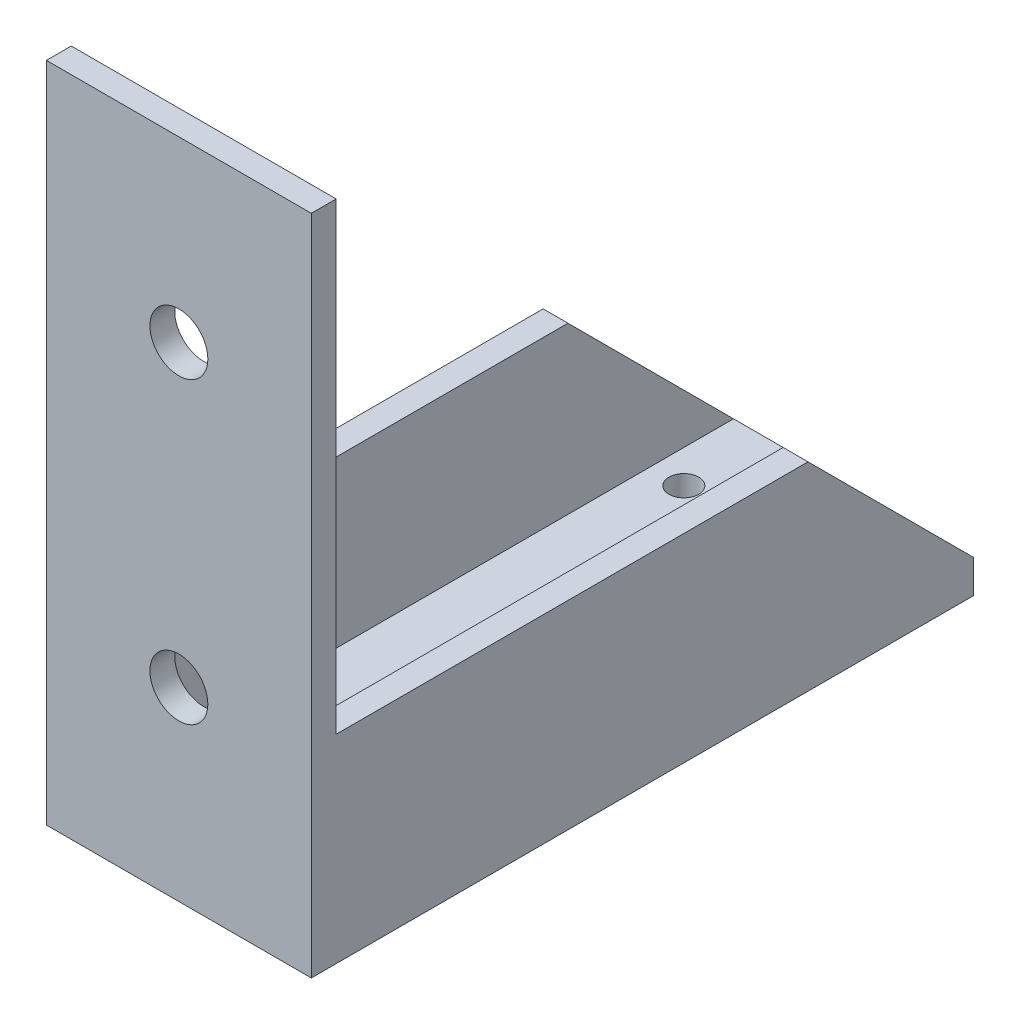
ISO-10303-21;
HEADER;
FILE_DESCRIPTION(('STEP AP214'),'2;1');
FILE_NAME('part.step','',(''),(''),'','','');
FILE_SCHEMA(('AUTOMOTIVE_DESIGN { 1 0 10303 214 1 1 1 1 }'));
ENDSEC;
DATA;
#1=APPLICATION_CONTEXT('core data for automotive mechanical design processes');
#2=APPLICATION_PROTOCOL_DEFINITION('international standard','automotive_design',2000,#1);
#3=PRODUCT_CONTEXT('',#1,'mechanical');
#4=PRODUCT('Part','Part','',(#3));
#5=PRODUCT_RELATED_PRODUCT_CATEGORY('part','',(#4));
#6=PRODUCT_DEFINITION_FORMATION('','',#4);
#7=PRODUCT_DEFINITION_CONTEXT('part definition',#1,'design');
#8=PRODUCT_DEFINITION('design','',#6,#7);
#9=PRODUCT_DEFINITION_SHAPE('','',#8);
#10=(LENGTH_UNIT() NAMED_UNIT(*) SI_UNIT(.MILLI.,.METRE.));
#11=(NAMED_UNIT(*) PLANE_ANGLE_UNIT() SI_UNIT($,.RADIAN.));
#12=(NAMED_UNIT(*) SI_UNIT($,.STERADIAN.) SOLID_ANGLE_UNIT());
#13=UNCERTAINTY_MEASURE_WITH_UNIT(LENGTH_MEASURE(1.E-05),#10,'distance_accuracy_value','');
#14=(GEOMETRIC_REPRESENTATION_CONTEXT(3) GLOBAL_UNCERTAINTY_ASSIGNED_CONTEXT((#13)) GLOBAL_UNIT_ASSIGNED_CONTEXT((#10,
#11,#12)) REPRESENTATION_CONTEXT('',''));
#15=CARTESIAN_POINT('',(0.,0.,0.));
#16=DIRECTION('',(0.,0.,1.));
#17=DIRECTION('',(1.,0.,0.));
#18=AXIS2_PLACEMENT_3D('',#15,#16,#17);
#19=CARTESIAN_POINT('',(0.,2.,0.));
#20=DIRECTION('',(0.,-1.,0.));
#21=DIRECTION('',(0.,0.,-1.));
#22=AXIS2_PLACEMENT_3D('',#19,#20,#21);
#23=PLANE('',#22);
#24=CARTESIAN_POINT('',(8.,2.,-35.));
#25=DIRECTION('',(0.,1.,0.));
#26=DIRECTION('',(0.,0.,1.));
#27=AXIS2_PLACEMENT_3D('',#24,#25,#26);
#28=CIRCLE('',#27,2.3);
#29=CARTESIAN_POINT('',(8.,2.,-32.7));
#30=VERTEX_POINT('',#29);
#31=EDGE_CURVE('E92',#30,#30,#28,.T.);
#32=ORIENTED_EDGE('',*,*,#31,.F.);
#33=EDGE_LOOP('',(#32));
#34=FACE_BOUND('',#33,.T.);
#35=CARTESIAN_POINT('',(3.5,2.,-35.));
#36=DIRECTION('',(0.,1.,0.));
#37=DIRECTION('',(0.,0.,1.));
#38=AXIS2_PLACEMENT_3D('',#35,#36,#37);
#39=CIRCLE('',#38,0.899999999999999);
#40=CARTESIAN_POINT('',(3.5,2.,-34.1));
#41=VERTEX_POINT('',#40);
#42=EDGE_CURVE('E189',#41,#41,#39,.T.);
#43=ORIENTED_EDGE('',*,*,#42,.F.);
#44=EDGE_LOOP('',(#43));
#45=FACE_BOUND('',#44,.T.);
#46=CARTESIAN_POINT('',(12.5,2.,-35.));
#47=DIRECTION('',(0.,1.,0.));
#48=DIRECTION('',(0.,0.,1.));
#49=AXIS2_PLACEMENT_3D('',#46,#47,#48);
#50=CIRCLE('',#49,0.9);
#51=CARTESIAN_POINT('',(12.5,2.,-34.1));
#52=VERTEX_POINT('',#51);
#53=EDGE_CURVE('E183',#52,#52,#50,.T.);
#54=ORIENTED_EDGE('',*,*,#53,.F.);
#55=EDGE_LOOP('',(#54));
#56=FACE_BOUND('',#55,.T.);
#57=DIRECTION('',(0.,0.,-1.));
#58=VECTOR('',#57,1.);
#59=CARTESIAN_POINT('',(1.5,2.,0.));
#60=LINE('',#59,#58);
#61=CARTESIAN_POINT('',(1.5,2.,-1.5));
#62=VERTEX_POINT('',#61);
#63=CARTESIAN_POINT('',(1.5,2.,-40.));
#64=VERTEX_POINT('',#63);
#65=EDGE_CURVE('E171',#62,#64,#60,.T.);
#66=ORIENTED_EDGE('',*,*,#65,.F.);
#67=DIRECTION('',(1.,0.,0.));
#68=VECTOR('',#67,1.);
#69=CARTESIAN_POINT('',(0.,2.,-1.5));
#70=LINE('',#69,#68);
#71=CARTESIAN_POINT('',(14.5,2.,-1.5));
#72=VERTEX_POINT('',#71);
#73=EDGE_CURVE('E131',#62,#72,#70,.T.);
#74=ORIENTED_EDGE('',*,*,#73,.T.);
#75=DIRECTION('',(0.,0.,-1.));
#76=VECTOR('',#75,1.);
#77=CARTESIAN_POINT('',(14.5,2.,0.));
#78=LINE('',#77,#76);
#79=CARTESIAN_POINT('',(14.5,2.,-40.));
#80=VERTEX_POINT('',#79);
#81=EDGE_CURVE('E154',#72,#80,#78,.T.);
#82=ORIENTED_EDGE('',*,*,#81,.T.);
#83=DIRECTION('',(-1.,0.,0.));
#84=VECTOR('',#83,1.);
#85=CARTESIAN_POINT('',(0.,2.,-40.));
#86=LINE('',#85,#84);
#87=EDGE_CURVE('E76',#80,#64,#86,.T.);
#88=ORIENTED_EDGE('',*,*,#87,.T.);
#89=EDGE_LOOP('',(#66,#74,#82,#88));
#90=FACE_BOUND('',#89,.T.);
#91=ADVANCED_FACE('F33',(#34,#45,#56,#90),#23,.F.);
#92=CARTESIAN_POINT('',(0.,0.,0.));
#93=DIRECTION('',(0.,-1.,0.));
#94=DIRECTION('',(0.,0.,-1.));
#95=AXIS2_PLACEMENT_3D('',#92,#93,#94);
#96=PLANE('',#95);
#97=DIRECTION('',(-1.,0.,0.));
#98=VECTOR('',#97,1.);
#99=CARTESIAN_POINT('',(0.,0.,-40.));
#100=LINE('',#99,#98);
#101=CARTESIAN_POINT('',(16.,0.,-40.));
#102=VERTEX_POINT('',#101);
#103=CARTESIAN_POINT('',(0.,0.,-40.));
#104=VERTEX_POINT('',#103);
#105=EDGE_CURVE('E70',#102,#104,#100,.T.);
#106=ORIENTED_EDGE('',*,*,#105,.F.);
#107=DIRECTION('',(0.,0.,-1.));
#108=VECTOR('',#107,1.);
#109=CARTESIAN_POINT('',(16.,0.,0.));
#110=LINE('',#109,#108);
#111=CARTESIAN_POINT('',(16.,0.,0.));
#112=VERTEX_POINT('',#111);
#113=EDGE_CURVE('E67',#112,#102,#110,.T.);
#114=ORIENTED_EDGE('',*,*,#113,.F.);
#115=DIRECTION('',(1.,0.,0.));
#116=VECTOR('',#115,1.);
#117=CARTESIAN_POINT('',(0.,0.,0.));
#118=LINE('',#117,#116);
#119=CARTESIAN_POINT('',(0.,0.,0.));
#120=VERTEX_POINT('',#119);
#121=EDGE_CURVE('E90',#120,#112,#118,.T.);
#122=ORIENTED_EDGE('',*,*,#121,.F.);
#123=DIRECTION('',(0.,0.,1.));
#124=VECTOR('',#123,1.);
#125=CARTESIAN_POINT('',(0.,0.,0.));
#126=LINE('',#125,#124);
#127=EDGE_CURVE('E81',#104,#120,#126,.T.);
#128=ORIENTED_EDGE('',*,*,#127,.F.);
#129=EDGE_LOOP('',(#106,#114,#122,#128));
#130=FACE_BOUND('',#129,.T.);
#131=CARTESIAN_POINT('',(3.5,0.,-35.));
#132=DIRECTION('',(0.,1.,0.));
#133=DIRECTION('',(0.,0.,1.));
#134=AXIS2_PLACEMENT_3D('',#131,#132,#133);
#135=CIRCLE('',#134,0.899999999999999);
#136=CARTESIAN_POINT('',(3.5,0.,-34.1));
#137=VERTEX_POINT('',#136);
#138=EDGE_CURVE('E186',#137,#137,#135,.T.);
#139=ORIENTED_EDGE('',*,*,#138,.T.);
#140=EDGE_LOOP('',(#139));
#141=FACE_BOUND('',#140,.T.);
#142=CARTESIAN_POINT('',(8.,0.,-35.));
#143=DIRECTION('',(0.,1.,0.));
#144=DIRECTION('',(0.,0.,1.));
#145=AXIS2_PLACEMENT_3D('',#142,#143,#144);
#146=CIRCLE('',#145,2.3);
#147=CARTESIAN_POINT('',(8.,0.,-32.7));
#148=VERTEX_POINT('',#147);
#149=EDGE_CURVE('E96',#148,#148,#146,.T.);
#150=ORIENTED_EDGE('',*,*,#149,.T.);
#151=EDGE_LOOP('',(#150));
#152=FACE_BOUND('',#151,.T.);
#153=CARTESIAN_POINT('',(12.5,0.,-35.));
#154=DIRECTION('',(0.,1.,0.));
#155=DIRECTION('',(0.,0.,1.));
#156=AXIS2_PLACEMENT_3D('',#153,#154,#155);
#157=CIRCLE('',#156,0.9);
#158=CARTESIAN_POINT('',(12.5,0.,-34.1));
#159=VERTEX_POINT('',#158);
#160=EDGE_CURVE('E182',#159,#159,#157,.T.);
#161=ORIENTED_EDGE('',*,*,#160,.T.);
#162=EDGE_LOOP('',(#161));
#163=FACE_BOUND('',#162,.T.);
#164=ADVANCED_FACE('F88',(#130,#141,#152,#163),#96,.T.);
#165=CARTESIAN_POINT('',(0.,2.,0.));
#166=DIRECTION('',(1.,0.,0.));
#167=DIRECTION('',(0.,0.,-1.));
#168=AXIS2_PLACEMENT_3D('',#165,#166,#167);
#169=PLANE('',#168);
#170=ORIENTED_EDGE('',*,*,#127,.T.);
#171=DIRECTION('',(0.,-1.,0.));
#172=VECTOR('',#171,1.);
#173=CARTESIAN_POINT('',(0.,2.,0.));
#174=LINE('',#173,#172);
#175=CARTESIAN_POINT('',(0.,40.,0.));
#176=VERTEX_POINT('',#175);
#177=EDGE_CURVE('E42',#176,#120,#174,.T.);
#178=ORIENTED_EDGE('',*,*,#177,.F.);
#179=DIRECTION('',(0.,0.,1.));
#180=VECTOR('',#179,1.);
#181=CARTESIAN_POINT('',(0.,40.,-1.5));
#182=LINE('',#181,#180);
#183=CARTESIAN_POINT('',(0.,40.,-1.5));
#184=VERTEX_POINT('',#183);
#185=EDGE_CURVE('E116',#184,#176,#182,.T.);
#186=ORIENTED_EDGE('',*,*,#185,.F.);
#187=DIRECTION('',(0.,-1.,0.));
#188=VECTOR('',#187,1.);
#189=CARTESIAN_POINT('',(0.,0.,-1.5));
#190=LINE('',#189,#188);
#191=CARTESIAN_POINT('',(0.,12.,-1.5));
#192=VERTEX_POINT('',#191);
#193=EDGE_CURVE('E401',#184,#192,#190,.T.);
#194=ORIENTED_EDGE('',*,*,#193,.T.);
#195=DIRECTION('',(0.,0.,1.));
#196=VECTOR('',#195,1.);
#197=CARTESIAN_POINT('',(0.,12.,-29.9999999999999));
#198=LINE('',#197,#196);
#199=CARTESIAN_POINT('',(0.,12.,-29.9999999999999));
#200=VERTEX_POINT('',#199);
#201=EDGE_CURVE('E168',#200,#192,#198,.T.);
#202=ORIENTED_EDGE('',*,*,#201,.F.);
#203=DIRECTION('',(0.,0.707106781186544,0.707106781186551));
#204=VECTOR('',#203,1.);
#205=CARTESIAN_POINT('',(0.,2.,-40.));
#206=LINE('',#205,#204);
#207=CARTESIAN_POINT('',(0.,2.,-40.));
#208=VERTEX_POINT('',#207);
#209=EDGE_CURVE('E85',#208,#200,#206,.T.);
#210=ORIENTED_EDGE('',*,*,#209,.F.);
#211=DIRECTION('',(0.,-1.,0.));
#212=VECTOR('',#211,1.);
#213=CARTESIAN_POINT('',(0.,2.,-40.));
#214=LINE('',#213,#212);
#215=EDGE_CURVE('E50',#208,#104,#214,.T.);
#216=ORIENTED_EDGE('',*,*,#215,.T.);
#217=EDGE_LOOP('',(#170,#178,#186,#194,#202,#210,#216));
#218=FACE_BOUND('',#217,.T.);
#219=ADVANCED_FACE('F35',(#218),#169,.F.);
#220=CARTESIAN_POINT('',(0.,2.,0.));
#221=DIRECTION('',(0.,0.,-1.));
#222=DIRECTION('',(-1.,0.,0.));
#223=AXIS2_PLACEMENT_3D('',#220,#221,#222);
#224=PLANE('',#223);
#225=DIRECTION('',(-1.,0.,0.));
#226=VECTOR('',#225,1.);
#227=CARTESIAN_POINT('',(0.,40.,0.));
#228=LINE('',#227,#226);
#229=CARTESIAN_POINT('',(16.,40.,0.));
#230=VERTEX_POINT('',#229);
#231=EDGE_CURVE('E111',#230,#176,#228,.T.);
#232=ORIENTED_EDGE('',*,*,#231,.T.);
#233=ORIENTED_EDGE('',*,*,#177,.T.);
#234=ORIENTED_EDGE('',*,*,#121,.T.);
#235=DIRECTION('',(0.,-1.,0.));
#236=VECTOR('',#235,1.);
#237=CARTESIAN_POINT('',(16.,2.,0.));
#238=LINE('',#237,#236);
#239=EDGE_CURVE('E103',#230,#112,#238,.T.);
#240=ORIENTED_EDGE('',*,*,#239,.F.);
#241=EDGE_LOOP('',(#232,#233,#234,#240));
#242=FACE_BOUND('',#241,.T.);
#243=CARTESIAN_POINT('',(8.,29.2496127751054,0.));
#244=DIRECTION('',(0.,0.,1.));
#245=DIRECTION('',(1.,0.,0.));
#246=AXIS2_PLACEMENT_3D('',#243,#244,#245);
#247=CIRCLE('',#246,1.75);
#248=CARTESIAN_POINT('',(9.75,29.2496127751054,0.));
#249=VERTEX_POINT('',#248);
#250=EDGE_CURVE('E441',#249,#249,#247,.T.);
#251=ORIENTED_EDGE('',*,*,#250,.F.);
#252=EDGE_LOOP('',(#251));
#253=FACE_BOUND('',#252,.T.);
#254=CARTESIAN_POINT('',(8.,11.1976212491855,0.));
#255=DIRECTION('',(0.,0.,1.));
#256=DIRECTION('',(1.,0.,0.));
#257=AXIS2_PLACEMENT_3D('',#254,#255,#256);
#258=CIRCLE('',#257,1.75);
#259=CARTESIAN_POINT('',(9.75,11.1976212491855,0.));
#260=VERTEX_POINT('',#259);
#261=EDGE_CURVE('E434',#260,#260,#258,.T.);
#262=ORIENTED_EDGE('',*,*,#261,.F.);
#263=EDGE_LOOP('',(#262));
#264=FACE_BOUND('',#263,.T.);
#265=ADVANCED_FACE('F106',(#242,#253,#264),#224,.F.);
#266=CARTESIAN_POINT('',(16.,2.,0.));
#267=DIRECTION('',(-1.,0.,0.));
#268=DIRECTION('',(0.,0.,1.));
#269=AXIS2_PLACEMENT_3D('',#266,#267,#268);
#270=PLANE('',#269);
#271=DIRECTION('',(0.,0.,1.));
#272=VECTOR('',#271,1.);
#273=CARTESIAN_POINT('',(16.,12.,-29.9999999999999));
#274=LINE('',#273,#272);
#275=CARTESIAN_POINT('',(16.,12.,-29.9999999999999));
#276=VERTEX_POINT('',#275);
#277=CARTESIAN_POINT('',(16.,12.,-1.5));
#278=VERTEX_POINT('',#277);
#279=EDGE_CURVE('E151',#276,#278,#274,.T.);
#280=ORIENTED_EDGE('',*,*,#279,.T.);
#281=DIRECTION('',(0.,1.,0.));
#282=VECTOR('',#281,1.);
#283=CARTESIAN_POINT('',(16.,0.,-1.5));
#284=LINE('',#283,#282);
#285=CARTESIAN_POINT('',(16.,40.,-1.5));
#286=VERTEX_POINT('',#285);
#287=EDGE_CURVE('E427',#278,#286,#284,.T.);
#288=ORIENTED_EDGE('',*,*,#287,.T.);
#289=DIRECTION('',(0.,0.,1.));
#290=VECTOR('',#289,1.);
#291=CARTESIAN_POINT('',(16.,40.,-1.5));
#292=LINE('',#291,#290);
#293=EDGE_CURVE('E128',#286,#230,#292,.T.);
#294=ORIENTED_EDGE('',*,*,#293,.T.);
#295=ORIENTED_EDGE('',*,*,#239,.T.);
#296=ORIENTED_EDGE('',*,*,#113,.T.);
#297=DIRECTION('',(0.,-1.,0.));
#298=VECTOR('',#297,1.);
#299=CARTESIAN_POINT('',(16.,2.,-40.));
#300=LINE('',#299,#298);
#301=CARTESIAN_POINT('',(16.,2.,-40.));
#302=VERTEX_POINT('',#301);
#303=EDGE_CURVE('E73',#302,#102,#300,.T.);
#304=ORIENTED_EDGE('',*,*,#303,.F.);
#305=DIRECTION('',(0.,0.707106781186544,0.707106781186551));
#306=VECTOR('',#305,1.);
#307=CARTESIAN_POINT('',(16.,2.,-40.));
#308=LINE('',#307,#306);
#309=EDGE_CURVE('E146',#302,#276,#308,.T.);
#310=ORIENTED_EDGE('',*,*,#309,.T.);
#311=EDGE_LOOP('',(#280,#288,#294,#295,#296,#304,#310));
#312=FACE_BOUND('',#311,.T.);
#313=ADVANCED_FACE('F210',(#312),#270,.F.);
#314=CARTESIAN_POINT('',(0.,2.,-40.));
#315=DIRECTION('',(0.,0.,1.));
#316=DIRECTION('',(1.,0.,0.));
#317=AXIS2_PLACEMENT_3D('',#314,#315,#316);
#318=PLANE('',#317);
#319=ORIENTED_EDGE('',*,*,#105,.T.);
#320=ORIENTED_EDGE('',*,*,#215,.F.);
#321=DIRECTION('',(-1.,0.,0.));
#322=VECTOR('',#321,1.);
#323=CARTESIAN_POINT('',(1.5,2.,-40.));
#324=LINE('',#323,#322);
#325=EDGE_CURVE('E174',#64,#208,#324,.T.);
#326=ORIENTED_EDGE('',*,*,#325,.F.);
#327=ORIENTED_EDGE('',*,*,#87,.F.);
#328=EDGE_CURVE('E86',#302,#80,#86,.T.);
#329=ORIENTED_EDGE('',*,*,#328,.F.);
#330=ORIENTED_EDGE('',*,*,#303,.T.);
#331=EDGE_LOOP('',(#319,#320,#326,#327,#329,#330));
#332=FACE_BOUND('',#331,.T.);
#333=ADVANCED_FACE('F71',(#332),#318,.F.);
#334=CARTESIAN_POINT('',(8.,2.,-35.));
#335=DIRECTION('',(0.,-1.,0.));
#336=DIRECTION('',(0.,0.,-1.));
#337=AXIS2_PLACEMENT_3D('',#334,#335,#336);
#338=CYLINDRICAL_SURFACE('',#337,2.3);
#339=ORIENTED_EDGE('',*,*,#31,.T.);
#340=EDGE_LOOP('',(#339));
#341=FACE_BOUND('',#340,.T.);
#342=ORIENTED_EDGE('',*,*,#149,.F.);
#343=EDGE_LOOP('',(#342));
#344=FACE_BOUND('',#343,.T.);
#345=ADVANCED_FACE('F198',(#341,#344),#338,.F.);
#346=CARTESIAN_POINT('',(3.5,2.,-35.));
#347=DIRECTION('',(0.,-1.,0.));
#348=DIRECTION('',(0.,0.,-1.));
#349=AXIS2_PLACEMENT_3D('',#346,#347,#348);
#350=CYLINDRICAL_SURFACE('',#349,0.899999999999999);
#351=ORIENTED_EDGE('',*,*,#42,.T.);
#352=EDGE_LOOP('',(#351));
#353=FACE_BOUND('',#352,.T.);
#354=ORIENTED_EDGE('',*,*,#138,.F.);
#355=EDGE_LOOP('',(#354));
#356=FACE_BOUND('',#355,.T.);
#357=ADVANCED_FACE('F200',(#353,#356),#350,.F.);
#358=CARTESIAN_POINT('',(12.5,2.,-35.));
#359=DIRECTION('',(0.,-1.,0.));
#360=DIRECTION('',(0.,0.,-1.));
#361=AXIS2_PLACEMENT_3D('',#358,#359,#360);
#362=CYLINDRICAL_SURFACE('',#361,0.9);
#363=ORIENTED_EDGE('',*,*,#53,.T.);
#364=EDGE_LOOP('',(#363));
#365=FACE_BOUND('',#364,.T.);
#366=ORIENTED_EDGE('',*,*,#160,.F.);
#367=EDGE_LOOP('',(#366));
#368=FACE_BOUND('',#367,.T.);
#369=ADVANCED_FACE('F207',(#365,#368),#362,.F.);
#370=CARTESIAN_POINT('',(1.5,2.,-40.));
#371=DIRECTION('',(0.,-0.707106781186551,0.707106781186544));
#372=DIRECTION('',(0.,-0.707106781186544,-0.707106781186551));
#373=AXIS2_PLACEMENT_3D('',#370,#371,#372);
#374=PLANE('',#373);
#375=ORIENTED_EDGE('',*,*,#209,.T.);
#376=DIRECTION('',(-1.,0.,0.));
#377=VECTOR('',#376,1.);
#378=CARTESIAN_POINT('',(1.5,12.,-29.9999999999999));
#379=LINE('',#378,#377);
#380=CARTESIAN_POINT('',(1.5,12.,-29.9999999999999));
#381=VERTEX_POINT('',#380);
#382=EDGE_CURVE('E179',#381,#200,#379,.T.);
#383=ORIENTED_EDGE('',*,*,#382,.F.);
#384=DIRECTION('',(0.,0.707106781186544,0.707106781186551));
#385=VECTOR('',#384,1.);
#386=CARTESIAN_POINT('',(1.5,2.,-40.));
#387=LINE('',#386,#385);
#388=EDGE_CURVE('E164',#64,#381,#387,.T.);
#389=ORIENTED_EDGE('',*,*,#388,.F.);
#390=ORIENTED_EDGE('',*,*,#325,.T.);
#391=EDGE_LOOP('',(#375,#383,#389,#390));
#392=FACE_BOUND('',#391,.T.);
#393=ADVANCED_FACE('F269',(#392),#374,.F.);
#394=CARTESIAN_POINT('',(1.5,12.,-29.9999999999999));
#395=DIRECTION('',(0.,-1.,0.));
#396=DIRECTION('',(0.,0.,-1.));
#397=AXIS2_PLACEMENT_3D('',#394,#395,#396);
#398=PLANE('',#397);
#399=ORIENTED_EDGE('',*,*,#201,.T.);
#400=DIRECTION('',(1.,0.,0.));
#401=VECTOR('',#400,1.);
#402=CARTESIAN_POINT('',(1.5,12.,-1.5));
#403=LINE('',#402,#401);
#404=CARTESIAN_POINT('',(1.5,12.,-1.5));
#405=VERTEX_POINT('',#404);
#406=EDGE_CURVE('E143',#192,#405,#403,.T.);
#407=ORIENTED_EDGE('',*,*,#406,.T.);
#408=DIRECTION('',(0.,0.,1.));
#409=VECTOR('',#408,1.);
#410=CARTESIAN_POINT('',(1.5,12.,-29.9999999999999));
#411=LINE('',#410,#409);
#412=EDGE_CURVE('E167',#381,#405,#411,.T.);
#413=ORIENTED_EDGE('',*,*,#412,.F.);
#414=ORIENTED_EDGE('',*,*,#382,.T.);
#415=EDGE_LOOP('',(#399,#407,#413,#414));
#416=FACE_BOUND('',#415,.T.);
#417=ADVANCED_FACE('F274',(#416),#398,.F.);
#418=CARTESIAN_POINT('',(1.5,0.,0.));
#419=DIRECTION('',(1.,0.,0.));
#420=DIRECTION('',(0.,0.,-1.));
#421=AXIS2_PLACEMENT_3D('',#418,#419,#420);
#422=PLANE('',#421);
#423=DIRECTION('',(0.,1.,0.));
#424=VECTOR('',#423,1.);
#425=CARTESIAN_POINT('',(1.5,0.,-1.5));
#426=LINE('',#425,#424);
#427=EDGE_CURVE('E140',#62,#405,#426,.T.);
#428=ORIENTED_EDGE('',*,*,#427,.F.);
#429=ORIENTED_EDGE('',*,*,#65,.T.);
#430=ORIENTED_EDGE('',*,*,#388,.T.);
#431=ORIENTED_EDGE('',*,*,#412,.T.);
#432=EDGE_LOOP('',(#428,#429,#430,#431));
#433=FACE_BOUND('',#432,.T.);
#434=ADVANCED_FACE('F251',(#433),#422,.T.);
#435=CARTESIAN_POINT('',(14.5,2.,-40.));
#436=DIRECTION('',(0.,0.707106781186551,-0.707106781186544));
#437=DIRECTION('',(0.,0.707106781186544,0.707106781186551));
#438=AXIS2_PLACEMENT_3D('',#435,#436,#437);
#439=PLANE('',#438);
#440=ORIENTED_EDGE('',*,*,#309,.F.);
#441=ORIENTED_EDGE('',*,*,#328,.T.);
#442=DIRECTION('',(0.,0.707106781186544,0.707106781186551));
#443=VECTOR('',#442,1.);
#444=CARTESIAN_POINT('',(14.5,2.,-40.));
#445=LINE('',#444,#443);
#446=CARTESIAN_POINT('',(14.5,12.,-29.9999999999999));
#447=VERTEX_POINT('',#446);
#448=EDGE_CURVE('E147',#80,#447,#445,.T.);
#449=ORIENTED_EDGE('',*,*,#448,.T.);
#450=DIRECTION('',(1.,0.,0.));
#451=VECTOR('',#450,1.);
#452=CARTESIAN_POINT('',(14.5,12.,-29.9999999999999));
#453=LINE('',#452,#451);
#454=EDGE_CURVE('E157',#447,#276,#453,.T.);
#455=ORIENTED_EDGE('',*,*,#454,.T.);
#456=EDGE_LOOP('',(#440,#441,#449,#455));
#457=FACE_BOUND('',#456,.T.);
#458=ADVANCED_FACE('F245',(#457),#439,.T.);
#459=CARTESIAN_POINT('',(14.5,12.,-29.9999999999999));
#460=DIRECTION('',(0.,1.,0.));
#461=DIRECTION('',(0.,0.,1.));
#462=AXIS2_PLACEMENT_3D('',#459,#460,#461);
#463=PLANE('',#462);
#464=DIRECTION('',(-1.,0.,0.));
#465=VECTOR('',#464,1.);
#466=CARTESIAN_POINT('',(14.5,12.,-1.5));
#467=LINE('',#466,#465);
#468=CARTESIAN_POINT('',(14.5,12.,-1.5));
#469=VERTEX_POINT('',#468);
#470=EDGE_CURVE('E127',#278,#469,#467,.T.);
#471=ORIENTED_EDGE('',*,*,#470,.F.);
#472=ORIENTED_EDGE('',*,*,#279,.F.);
#473=ORIENTED_EDGE('',*,*,#454,.F.);
#474=DIRECTION('',(0.,0.,1.));
#475=VECTOR('',#474,1.);
#476=CARTESIAN_POINT('',(14.5,12.,-29.9999999999999));
#477=LINE('',#476,#475);
#478=EDGE_CURVE('E150',#447,#469,#477,.T.);
#479=ORIENTED_EDGE('',*,*,#478,.T.);
#480=EDGE_LOOP('',(#471,#472,#473,#479));
#481=FACE_BOUND('',#480,.T.);
#482=ADVANCED_FACE('F250',(#481),#463,.T.);
#483=CARTESIAN_POINT('',(14.5,0.,0.));
#484=DIRECTION('',(1.,0.,0.));
#485=DIRECTION('',(0.,0.,-1.));
#486=AXIS2_PLACEMENT_3D('',#483,#484,#485);
#487=PLANE('',#486);
#488=ORIENTED_EDGE('',*,*,#81,.F.);
#489=DIRECTION('',(0.,1.,0.));
#490=VECTOR('',#489,1.);
#491=CARTESIAN_POINT('',(14.5,0.,-1.5));
#492=LINE('',#491,#490);
#493=EDGE_CURVE('E11',#72,#469,#492,.T.);
#494=ORIENTED_EDGE('',*,*,#493,.T.);
#495=ORIENTED_EDGE('',*,*,#478,.F.);
#496=ORIENTED_EDGE('',*,*,#448,.F.);
#497=EDGE_LOOP('',(#488,#494,#495,#496));
#498=FACE_BOUND('',#497,.T.);
#499=ADVANCED_FACE('F335',(#498),#487,.F.);
#500=CARTESIAN_POINT('',(0.,0.,-1.5));
#501=DIRECTION('',(0.,0.,-1.));
#502=DIRECTION('',(-1.,0.,0.));
#503=AXIS2_PLACEMENT_3D('',#500,#501,#502);
#504=PLANE('',#503);
#505=CARTESIAN_POINT('',(8.,11.1976212491855,-1.5));
#506=DIRECTION('',(0.,0.,1.));
#507=DIRECTION('',(1.,0.,0.));
#508=AXIS2_PLACEMENT_3D('',#505,#506,#507);
#509=CIRCLE('',#508,1.75);
#510=CARTESIAN_POINT('',(9.75,11.1976212491855,-1.5));
#511=VERTEX_POINT('',#510);
#512=EDGE_CURVE('E437',#511,#511,#509,.T.);
#513=ORIENTED_EDGE('',*,*,#512,.T.);
#514=EDGE_LOOP('',(#513));
#515=FACE_BOUND('',#514,.T.);
#516=CARTESIAN_POINT('',(8.,29.2496127751054,-1.5));
#517=DIRECTION('',(0.,0.,1.));
#518=DIRECTION('',(1.,0.,0.));
#519=AXIS2_PLACEMENT_3D('',#516,#517,#518);
#520=CIRCLE('',#519,1.75);
#521=CARTESIAN_POINT('',(9.75,29.2496127751054,-1.5));
#522=VERTEX_POINT('',#521);
#523=EDGE_CURVE('E438',#522,#522,#520,.T.);
#524=ORIENTED_EDGE('',*,*,#523,.T.);
#525=EDGE_LOOP('',(#524));
#526=FACE_BOUND('',#525,.T.);
#527=ORIENTED_EDGE('',*,*,#406,.F.);
#528=ORIENTED_EDGE('',*,*,#193,.F.);
#529=DIRECTION('',(-1.,0.,0.));
#530=VECTOR('',#529,1.);
#531=CARTESIAN_POINT('',(0.,40.,-1.5));
#532=LINE('',#531,#530);
#533=EDGE_CURVE('E126',#286,#184,#532,.T.);
#534=ORIENTED_EDGE('',*,*,#533,.F.);
#535=ORIENTED_EDGE('',*,*,#287,.F.);
#536=ORIENTED_EDGE('',*,*,#470,.T.);
#537=ORIENTED_EDGE('',*,*,#493,.F.);
#538=ORIENTED_EDGE('',*,*,#73,.F.);
#539=ORIENTED_EDGE('',*,*,#427,.T.);
#540=EDGE_LOOP('',(#527,#528,#534,#535,#536,#537,#538,#539));
#541=FACE_BOUND('',#540,.T.);
#542=ADVANCED_FACE('F329',(#515,#526,#541),#504,.T.);
#543=CARTESIAN_POINT('',(0.,40.,-1.5));
#544=DIRECTION('',(0.,1.,0.));
#545=DIRECTION('',(0.,0.,1.));
#546=AXIS2_PLACEMENT_3D('',#543,#544,#545);
#547=PLANE('',#546);
#548=ORIENTED_EDGE('',*,*,#231,.F.);
#549=ORIENTED_EDGE('',*,*,#293,.F.);
#550=ORIENTED_EDGE('',*,*,#533,.T.);
#551=ORIENTED_EDGE('',*,*,#185,.T.);
#552=EDGE_LOOP('',(#548,#549,#550,#551));
#553=FACE_BOUND('',#552,.T.);
#554=ADVANCED_FACE('F123',(#553),#547,.T.);
#555=CARTESIAN_POINT('',(8.,11.1976212491855,-1.5));
#556=DIRECTION('',(0.,0.,1.));
#557=DIRECTION('',(1.,0.,0.));
#558=AXIS2_PLACEMENT_3D('',#555,#556,#557);
#559=CYLINDRICAL_SURFACE('',#558,1.75);
#560=ORIENTED_EDGE('',*,*,#512,.F.);
#561=EDGE_LOOP('',(#560));
#562=FACE_BOUND('',#561,.T.);
#563=ORIENTED_EDGE('',*,*,#261,.T.);
#564=EDGE_LOOP('',(#563));
#565=FACE_BOUND('',#564,.T.);
#566=ADVANCED_FACE('F345',(#562,#565),#559,.F.);
#567=CARTESIAN_POINT('',(8.,29.2496127751054,-1.5));
#568=DIRECTION('',(0.,0.,1.));
#569=DIRECTION('',(1.,0.,0.));
#570=AXIS2_PLACEMENT_3D('',#567,#568,#569);
#571=CYLINDRICAL_SURFACE('',#570,1.75);
#572=ORIENTED_EDGE('',*,*,#523,.F.);
#573=EDGE_LOOP('',(#572));
#574=FACE_BOUND('',#573,.T.);
#575=ORIENTED_EDGE('',*,*,#250,.T.);
#576=EDGE_LOOP('',(#575));
#577=FACE_BOUND('',#576,.T.);
#578=ADVANCED_FACE('F353',(#574,#577),#571,.F.);
#579=CLOSED_SHELL('',(#91,#164,#219,#265,#313,#333,#345,#357,#369,#393,#417,#434,#458,#482,#499,
#542,#554,#566,#578));
#580=MANIFOLD_SOLID_BREP('B2',#579);
#581=ADVANCED_BREP_SHAPE_REPRESENTATION('',(#18,#580),#14);
#582=SHAPE_DEFINITION_REPRESENTATION(#9,#581);
ENDSEC;
END-ISO-10303-21;
